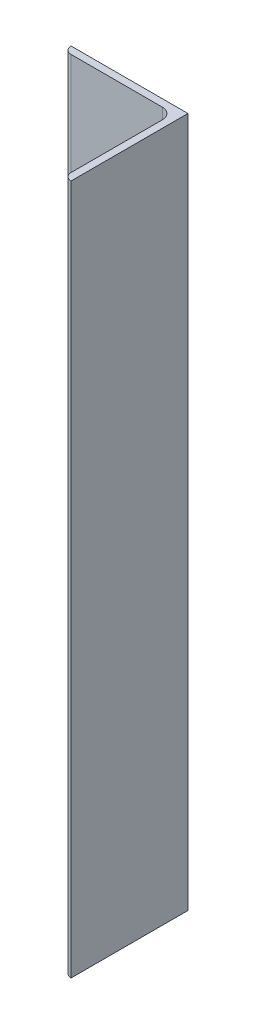
ISO-10303-21;
HEADER;
FILE_DESCRIPTION(('STEP AP214'),'2;1');
FILE_NAME('part.step','',(''),(''),'','','');
FILE_SCHEMA(('AUTOMOTIVE_DESIGN { 1 0 10303 214 1 1 1 1 }'));
ENDSEC;
DATA;
#1=APPLICATION_CONTEXT('core data for automotive mechanical design processes');
#2=APPLICATION_PROTOCOL_DEFINITION('international standard','automotive_design',2000,#1);
#3=PRODUCT_CONTEXT('',#1,'mechanical');
#4=PRODUCT('Part','Part','',(#3));
#5=PRODUCT_RELATED_PRODUCT_CATEGORY('part','',(#4));
#6=PRODUCT_DEFINITION_FORMATION('','',#4);
#7=PRODUCT_DEFINITION_CONTEXT('part definition',#1,'design');
#8=PRODUCT_DEFINITION('design','',#6,#7);
#9=PRODUCT_DEFINITION_SHAPE('','',#8);
#10=(LENGTH_UNIT() NAMED_UNIT(*) SI_UNIT(.MILLI.,.METRE.));
#11=(NAMED_UNIT(*) PLANE_ANGLE_UNIT() SI_UNIT($,.RADIAN.));
#12=(NAMED_UNIT(*) SI_UNIT($,.STERADIAN.) SOLID_ANGLE_UNIT());
#13=UNCERTAINTY_MEASURE_WITH_UNIT(LENGTH_MEASURE(1.E-05),#10,'distance_accuracy_value','');
#14=(GEOMETRIC_REPRESENTATION_CONTEXT(3) GLOBAL_UNCERTAINTY_ASSIGNED_CONTEXT((#13)) GLOBAL_UNIT_ASSIGNED_CONTEXT((#10,
#11,#12)) REPRESENTATION_CONTEXT('',''));
#15=CARTESIAN_POINT('',(0.,0.,0.));
#16=DIRECTION('',(0.,0.,1.));
#17=DIRECTION('',(1.,0.,0.));
#18=AXIS2_PLACEMENT_3D('',#15,#16,#17);
#19=CARTESIAN_POINT('',(-50.8,150.,0.));
#20=DIRECTION('',(0.,0.,1.));
#21=DIRECTION('',(1.,0.,0.));
#22=AXIS2_PLACEMENT_3D('',#19,#20,#21);
#23=PLANE('',#22);
#24=DIRECTION('',(-1.,0.,0.));
#25=VECTOR('',#24,1.);
#26=CARTESIAN_POINT('',(-50.8,-150.,0.));
#27=LINE('',#26,#25);
#28=CARTESIAN_POINT('',(0.,-150.,0.));
#29=VERTEX_POINT('',#28);
#30=CARTESIAN_POINT('',(-50.8,-150.,0.));
#31=VERTEX_POINT('',#30);
#32=EDGE_CURVE('E168',#29,#31,#27,.T.);
#33=ORIENTED_EDGE('',*,*,#32,.T.);
#34=DIRECTION('',(0.,-1.,0.));
#35=VECTOR('',#34,1.);
#36=CARTESIAN_POINT('',(-50.8,150.,0.));
#37=LINE('',#36,#35);
#38=CARTESIAN_POINT('',(-50.8,150.,0.));
#39=VERTEX_POINT('',#38);
#40=EDGE_CURVE('E13',#39,#31,#37,.T.);
#41=ORIENTED_EDGE('',*,*,#40,.F.);
#42=DIRECTION('',(-1.,0.,0.));
#43=VECTOR('',#42,1.);
#44=CARTESIAN_POINT('',(-50.8,150.,0.));
#45=LINE('',#44,#43);
#46=CARTESIAN_POINT('',(0.,150.,0.));
#47=VERTEX_POINT('',#46);
#48=EDGE_CURVE('E184',#47,#39,#45,.T.);
#49=ORIENTED_EDGE('',*,*,#48,.F.);
#50=DIRECTION('',(0.,-1.,0.));
#51=VECTOR('',#50,1.);
#52=CARTESIAN_POINT('',(0.,150.,0.));
#53=LINE('',#52,#51);
#54=EDGE_CURVE('E164',#47,#29,#53,.T.);
#55=ORIENTED_EDGE('',*,*,#54,.T.);
#56=EDGE_LOOP('',(#33,#41,#49,#55));
#57=FACE_BOUND('',#56,.T.);
#58=ADVANCED_FACE('F66',(#57),#23,.F.);
#59=CARTESIAN_POINT('',(-50.8,150.,0.00508));
#60=DIRECTION('',(1.,0.,0.));
#61=DIRECTION('',(0.,0.,-1.));
#62=AXIS2_PLACEMENT_3D('',#59,#60,#61);
#63=PLANE('',#62);
#64=DIRECTION('',(0.,0.,1.));
#65=VECTOR('',#64,1.);
#66=CARTESIAN_POINT('',(-50.8,-150.,0.00508));
#67=LINE('',#66,#65);
#68=CARTESIAN_POINT('',(-50.8,-150.,0.00507999999999903));
#69=VERTEX_POINT('',#68);
#70=EDGE_CURVE('E171',#31,#69,#67,.T.);
#71=ORIENTED_EDGE('',*,*,#70,.T.);
#72=DIRECTION('',(0.,-1.,0.));
#73=VECTOR('',#72,1.);
#74=CARTESIAN_POINT('',(-50.8,150.,0.00507999999999903));
#75=LINE('',#74,#73);
#76=CARTESIAN_POINT('',(-50.8,150.,0.00507999999999903));
#77=VERTEX_POINT('',#76);
#78=EDGE_CURVE('E74',#77,#69,#75,.T.);
#79=ORIENTED_EDGE('',*,*,#78,.F.);
#80=DIRECTION('',(0.,0.,1.));
#81=VECTOR('',#80,1.);
#82=CARTESIAN_POINT('',(-50.8,150.,0.00508));
#83=LINE('',#82,#81);
#84=EDGE_CURVE('E128',#39,#77,#83,.T.);
#85=ORIENTED_EDGE('',*,*,#84,.F.);
#86=ORIENTED_EDGE('',*,*,#40,.T.);
#87=EDGE_LOOP('',(#71,#79,#85,#86));
#88=FACE_BOUND('',#87,.T.);
#89=ADVANCED_FACE('F227',(#88),#63,.F.);
#90=CARTESIAN_POINT('',(-47.63008,150.,0.00507999999999961));
#91=DIRECTION('',(0.,-1.,0.));
#92=DIRECTION('',(0.,0.,-1.));
#93=AXIS2_PLACEMENT_3D('',#90,#91,#92);
#94=CYLINDRICAL_SURFACE('',#93,3.16992);
#95=CARTESIAN_POINT('',(-47.63008,-150.,0.00507999999999961));
#96=DIRECTION('',(0.,1.,0.));
#97=DIRECTION('',(0.,0.,1.));
#98=AXIS2_PLACEMENT_3D('',#95,#96,#97);
#99=CIRCLE('',#98,3.16992);
#100=CARTESIAN_POINT('',(-47.63008,-150.,3.175));
#101=VERTEX_POINT('',#100);
#102=EDGE_CURVE('E173',#69,#101,#99,.T.);
#103=ORIENTED_EDGE('',*,*,#102,.T.);
#104=DIRECTION('',(0.,-1.,0.));
#105=VECTOR('',#104,1.);
#106=CARTESIAN_POINT('',(-47.63008,150.,3.175));
#107=LINE('',#106,#105);
#108=CARTESIAN_POINT('',(-47.63008,150.,3.175));
#109=VERTEX_POINT('',#108);
#110=EDGE_CURVE('E194',#109,#101,#107,.T.);
#111=ORIENTED_EDGE('',*,*,#110,.F.);
#112=CARTESIAN_POINT('',(-47.63008,150.,0.00507999999999961));
#113=DIRECTION('',(0.,1.,0.));
#114=DIRECTION('',(0.,0.,1.));
#115=AXIS2_PLACEMENT_3D('',#112,#113,#114);
#116=CIRCLE('',#115,3.16992);
#117=EDGE_CURVE('E202',#77,#109,#116,.T.);
#118=ORIENTED_EDGE('',*,*,#117,.F.);
#119=ORIENTED_EDGE('',*,*,#78,.T.);
#120=EDGE_LOOP('',(#103,#111,#118,#119));
#121=FACE_BOUND('',#120,.T.);
#122=ADVANCED_FACE('F200',(#121),#94,.T.);
#123=CARTESIAN_POINT('',(-7.93750000000001,150.,3.17499999999999));
#124=DIRECTION('',(0.,0.,-1.));
#125=DIRECTION('',(-1.,0.,0.));
#126=AXIS2_PLACEMENT_3D('',#123,#124,#125);
#127=PLANE('',#126);
#128=DIRECTION('',(1.,0.,0.));
#129=VECTOR('',#128,1.);
#130=CARTESIAN_POINT('',(-7.93750000000001,-150.,3.17499999999999));
#131=LINE('',#130,#129);
#132=CARTESIAN_POINT('',(-7.93750000000001,-150.,3.17499999999999));
#133=VERTEX_POINT('',#132);
#134=EDGE_CURVE('E175',#101,#133,#131,.T.);
#135=ORIENTED_EDGE('',*,*,#134,.T.);
#136=DIRECTION('',(0.,-1.,0.));
#137=VECTOR('',#136,1.);
#138=CARTESIAN_POINT('',(-7.93750000000001,150.,3.17499999999999));
#139=LINE('',#138,#137);
#140=CARTESIAN_POINT('',(-7.93750000000001,150.,3.17499999999999));
#141=VERTEX_POINT('',#140);
#142=EDGE_CURVE('E191',#141,#133,#139,.T.);
#143=ORIENTED_EDGE('',*,*,#142,.F.);
#144=DIRECTION('',(1.,0.,0.));
#145=VECTOR('',#144,1.);
#146=CARTESIAN_POINT('',(-7.93750000000001,150.,3.17499999999999));
#147=LINE('',#146,#145);
#148=EDGE_CURVE('E218',#109,#141,#147,.T.);
#149=ORIENTED_EDGE('',*,*,#148,.F.);
#150=ORIENTED_EDGE('',*,*,#110,.T.);
#151=EDGE_LOOP('',(#135,#143,#149,#150));
#152=FACE_BOUND('',#151,.T.);
#153=ADVANCED_FACE('F211',(#152),#127,.F.);
#154=CARTESIAN_POINT('',(-7.93750000000001,150.,7.93749999999999));
#155=DIRECTION('',(0.,-1.,0.));
#156=DIRECTION('',(0.,0.,-1.));
#157=AXIS2_PLACEMENT_3D('',#154,#155,#156);
#158=CYLINDRICAL_SURFACE('',#157,4.7625);
#159=CARTESIAN_POINT('',(-7.93750000000001,-150.,7.93749999999999));
#160=DIRECTION('',(0.,-1.,0.));
#161=DIRECTION('',(0.,0.,-1.));
#162=AXIS2_PLACEMENT_3D('',#159,#160,#161);
#163=CIRCLE('',#162,4.7625);
#164=CARTESIAN_POINT('',(-3.17500000000001,-150.,7.93749999999999));
#165=VERTEX_POINT('',#164);
#166=EDGE_CURVE('E177',#133,#165,#163,.T.);
#167=ORIENTED_EDGE('',*,*,#166,.T.);
#168=DIRECTION('',(0.,-1.,0.));
#169=VECTOR('',#168,1.);
#170=CARTESIAN_POINT('',(-3.17500000000001,150.,7.93749999999999));
#171=LINE('',#170,#169);
#172=CARTESIAN_POINT('',(-3.17500000000001,150.,7.93749999999999));
#173=VERTEX_POINT('',#172);
#174=EDGE_CURVE('E188',#173,#165,#171,.T.);
#175=ORIENTED_EDGE('',*,*,#174,.F.);
#176=CARTESIAN_POINT('',(-7.93750000000001,150.,7.93749999999999));
#177=DIRECTION('',(0.,-1.,0.));
#178=DIRECTION('',(0.,0.,-1.));
#179=AXIS2_PLACEMENT_3D('',#176,#177,#178);
#180=CIRCLE('',#179,4.7625);
#181=EDGE_CURVE('E217',#141,#173,#180,.T.);
#182=ORIENTED_EDGE('',*,*,#181,.F.);
#183=ORIENTED_EDGE('',*,*,#142,.T.);
#184=EDGE_LOOP('',(#167,#175,#182,#183));
#185=FACE_BOUND('',#184,.T.);
#186=ADVANCED_FACE('F215',(#185),#158,.F.);
#187=CARTESIAN_POINT('',(-3.175,150.,47.63008));
#188=DIRECTION('',(1.,0.,0.));
#189=DIRECTION('',(0.,0.,-1.));
#190=AXIS2_PLACEMENT_3D('',#187,#188,#189);
#191=PLANE('',#190);
#192=DIRECTION('',(0.,0.,1.));
#193=VECTOR('',#192,1.);
#194=CARTESIAN_POINT('',(-3.175,-150.,47.63008));
#195=LINE('',#194,#193);
#196=CARTESIAN_POINT('',(-3.175,-150.,47.63008));
#197=VERTEX_POINT('',#196);
#198=EDGE_CURVE('E179',#165,#197,#195,.T.);
#199=ORIENTED_EDGE('',*,*,#198,.T.);
#200=DIRECTION('',(0.,-1.,0.));
#201=VECTOR('',#200,1.);
#202=CARTESIAN_POINT('',(-3.175,150.,47.63008));
#203=LINE('',#202,#201);
#204=CARTESIAN_POINT('',(-3.175,150.,47.63008));
#205=VERTEX_POINT('',#204);
#206=EDGE_CURVE('E159',#205,#197,#203,.T.);
#207=ORIENTED_EDGE('',*,*,#206,.F.);
#208=DIRECTION('',(0.,0.,1.));
#209=VECTOR('',#208,1.);
#210=CARTESIAN_POINT('',(-3.175,150.,47.63008));
#211=LINE('',#210,#209);
#212=EDGE_CURVE('E150',#173,#205,#211,.T.);
#213=ORIENTED_EDGE('',*,*,#212,.F.);
#214=ORIENTED_EDGE('',*,*,#174,.T.);
#215=EDGE_LOOP('',(#199,#207,#213,#214));
#216=FACE_BOUND('',#215,.T.);
#217=ADVANCED_FACE('F239',(#216),#191,.F.);
#218=CARTESIAN_POINT('',(-0.00508000000000019,150.,47.63008));
#219=DIRECTION('',(0.,-1.,0.));
#220=DIRECTION('',(0.,0.,-1.));
#221=AXIS2_PLACEMENT_3D('',#218,#219,#220);
#222=CYLINDRICAL_SURFACE('',#221,3.16992);
#223=CARTESIAN_POINT('',(-0.00508000000000019,-150.,47.63008));
#224=DIRECTION('',(0.,1.,0.));
#225=DIRECTION('',(0.,0.,-1.));
#226=AXIS2_PLACEMENT_3D('',#223,#224,#225);
#227=CIRCLE('',#226,3.16992);
#228=CARTESIAN_POINT('',(-0.00508,-150.,50.8));
#229=VERTEX_POINT('',#228);
#230=EDGE_CURVE('E158',#197,#229,#227,.T.);
#231=ORIENTED_EDGE('',*,*,#230,.T.);
#232=DIRECTION('',(0.,-1.,0.));
#233=VECTOR('',#232,1.);
#234=CARTESIAN_POINT('',(-0.00508,150.,50.8));
#235=LINE('',#234,#233);
#236=CARTESIAN_POINT('',(-0.00508,150.,50.8));
#237=VERTEX_POINT('',#236);
#238=EDGE_CURVE('E155',#237,#229,#235,.T.);
#239=ORIENTED_EDGE('',*,*,#238,.F.);
#240=CARTESIAN_POINT('',(-0.00508000000000019,150.,47.63008));
#241=DIRECTION('',(0.,1.,0.));
#242=DIRECTION('',(0.,0.,-1.));
#243=AXIS2_PLACEMENT_3D('',#240,#241,#242);
#244=CIRCLE('',#243,3.16992);
#245=EDGE_CURVE('E144',#205,#237,#244,.T.);
#246=ORIENTED_EDGE('',*,*,#245,.F.);
#247=ORIENTED_EDGE('',*,*,#206,.T.);
#248=EDGE_LOOP('',(#231,#239,#246,#247));
#249=FACE_BOUND('',#248,.T.);
#250=ADVANCED_FACE('F156',(#249),#222,.T.);
#251=CARTESIAN_POINT('',(0.,150.,50.8));
#252=DIRECTION('',(0.,0.,-1.));
#253=DIRECTION('',(-1.,0.,0.));
#254=AXIS2_PLACEMENT_3D('',#251,#252,#253);
#255=PLANE('',#254);
#256=DIRECTION('',(1.,0.,0.));
#257=VECTOR('',#256,1.);
#258=CARTESIAN_POINT('',(0.,-150.,50.8));
#259=LINE('',#258,#257);
#260=CARTESIAN_POINT('',(0.,-150.,50.8));
#261=VERTEX_POINT('',#260);
#262=EDGE_CURVE('E114',#229,#261,#259,.T.);
#263=ORIENTED_EDGE('',*,*,#262,.T.);
#264=DIRECTION('',(0.,-1.,0.));
#265=VECTOR('',#264,1.);
#266=CARTESIAN_POINT('',(0.,150.,50.8));
#267=LINE('',#266,#265);
#268=CARTESIAN_POINT('',(0.,150.,50.8));
#269=VERTEX_POINT('',#268);
#270=EDGE_CURVE('E160',#269,#261,#267,.T.);
#271=ORIENTED_EDGE('',*,*,#270,.F.);
#272=DIRECTION('',(1.,0.,0.));
#273=VECTOR('',#272,1.);
#274=CARTESIAN_POINT('',(0.,150.,50.8));
#275=LINE('',#274,#273);
#276=EDGE_CURVE('E148',#237,#269,#275,.T.);
#277=ORIENTED_EDGE('',*,*,#276,.F.);
#278=ORIENTED_EDGE('',*,*,#238,.T.);
#279=EDGE_LOOP('',(#263,#271,#277,#278));
#280=FACE_BOUND('',#279,.T.);
#281=ADVANCED_FACE('F162',(#280),#255,.F.);
#282=CARTESIAN_POINT('',(0.,150.,0.));
#283=DIRECTION('',(-1.,0.,0.));
#284=DIRECTION('',(0.,0.,1.));
#285=AXIS2_PLACEMENT_3D('',#282,#283,#284);
#286=PLANE('',#285);
#287=DIRECTION('',(0.,0.,-1.));
#288=VECTOR('',#287,1.);
#289=CARTESIAN_POINT('',(0.,-150.,0.));
#290=LINE('',#289,#288);
#291=EDGE_CURVE('E120',#261,#29,#290,.T.);
#292=ORIENTED_EDGE('',*,*,#291,.T.);
#293=ORIENTED_EDGE('',*,*,#54,.F.);
#294=DIRECTION('',(0.,0.,-1.));
#295=VECTOR('',#294,1.);
#296=CARTESIAN_POINT('',(0.,150.,0.));
#297=LINE('',#296,#295);
#298=EDGE_CURVE('E82',#269,#47,#297,.T.);
#299=ORIENTED_EDGE('',*,*,#298,.F.);
#300=ORIENTED_EDGE('',*,*,#270,.T.);
#301=EDGE_LOOP('',(#292,#293,#299,#300));
#302=FACE_BOUND('',#301,.T.);
#303=ADVANCED_FACE('F247',(#302),#286,.F.);
#304=CARTESIAN_POINT('',(-0.00508000000000019,150.,47.63008));
#305=DIRECTION('',(0.,-1.,0.));
#306=DIRECTION('',(0.,0.,-1.));
#307=AXIS2_PLACEMENT_3D('',#304,#305,#306);
#308=PLANE('',#307);
#309=ORIENTED_EDGE('',*,*,#48,.T.);
#310=ORIENTED_EDGE('',*,*,#84,.T.);
#311=ORIENTED_EDGE('',*,*,#117,.T.);
#312=ORIENTED_EDGE('',*,*,#148,.T.);
#313=ORIENTED_EDGE('',*,*,#181,.T.);
#314=ORIENTED_EDGE('',*,*,#212,.T.);
#315=ORIENTED_EDGE('',*,*,#245,.T.);
#316=ORIENTED_EDGE('',*,*,#276,.T.);
#317=ORIENTED_EDGE('',*,*,#298,.T.);
#318=EDGE_LOOP('',(#309,#310,#311,#312,#313,#314,#315,#316,#317));
#319=FACE_BOUND('',#318,.T.);
#320=ADVANCED_FACE('F146',(#319),#308,.F.);
#321=CARTESIAN_POINT('',(-0.00508000000000019,-150.,47.63008));
#322=DIRECTION('',(0.,-1.,0.));
#323=DIRECTION('',(0.,0.,-1.));
#324=AXIS2_PLACEMENT_3D('',#321,#322,#323);
#325=PLANE('',#324);
#326=ORIENTED_EDGE('',*,*,#32,.F.);
#327=ORIENTED_EDGE('',*,*,#291,.F.);
#328=ORIENTED_EDGE('',*,*,#262,.F.);
#329=ORIENTED_EDGE('',*,*,#230,.F.);
#330=ORIENTED_EDGE('',*,*,#198,.F.);
#331=ORIENTED_EDGE('',*,*,#166,.F.);
#332=ORIENTED_EDGE('',*,*,#134,.F.);
#333=ORIENTED_EDGE('',*,*,#102,.F.);
#334=ORIENTED_EDGE('',*,*,#70,.F.);
#335=EDGE_LOOP('',(#326,#327,#328,#329,#330,#331,#332,#333,#334));
#336=FACE_BOUND('',#335,.T.);
#337=ADVANCED_FACE('F206',(#336),#325,.T.);
#338=CLOSED_SHELL('',(#58,#89,#122,#153,#186,#217,#250,#281,#303,#320,#337));
#339=MANIFOLD_SOLID_BREP('B2',#338);
#340=ADVANCED_BREP_SHAPE_REPRESENTATION('',(#18,#339),#14);
#341=SHAPE_DEFINITION_REPRESENTATION(#9,#340);
ENDSEC;
END-ISO-10303-21;
